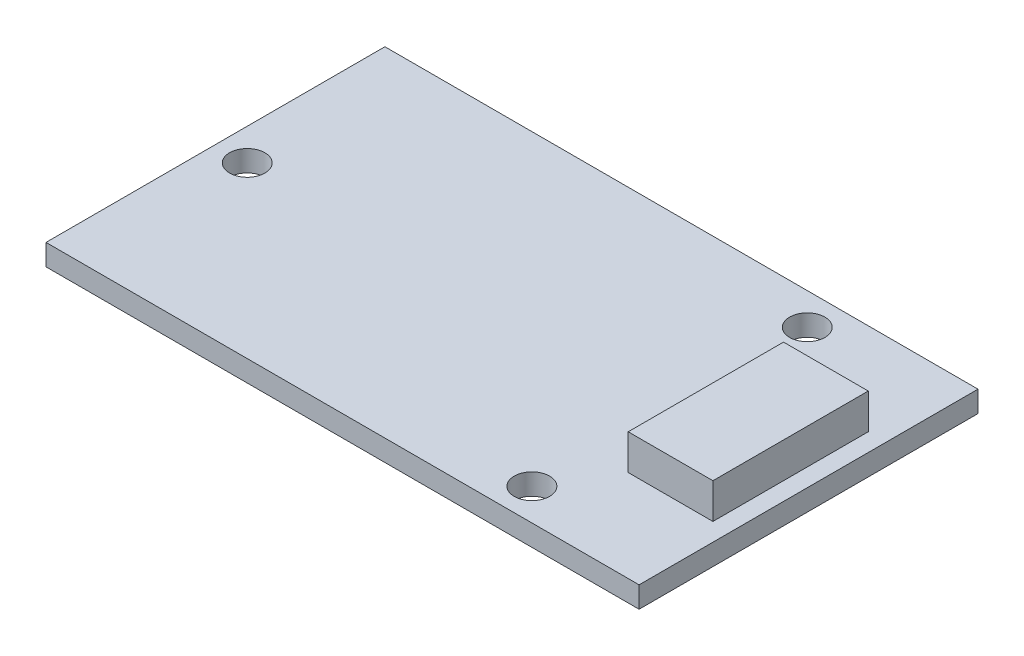
ISO-10303-21;
HEADER;
FILE_DESCRIPTION(('STEP AP214'),'2;1');
FILE_NAME('part.step','',(''),(''),'','','');
FILE_SCHEMA(('AUTOMOTIVE_DESIGN { 1 0 10303 214 1 1 1 1 }'));
ENDSEC;
DATA;
#1=APPLICATION_CONTEXT('core data for automotive mechanical design processes');
#2=APPLICATION_PROTOCOL_DEFINITION('international standard','automotive_design',2000,#1);
#3=PRODUCT_CONTEXT('',#1,'mechanical');
#4=PRODUCT('Part','Part','',(#3));
#5=PRODUCT_RELATED_PRODUCT_CATEGORY('part','',(#4));
#6=PRODUCT_DEFINITION_FORMATION('','',#4);
#7=PRODUCT_DEFINITION_CONTEXT('part definition',#1,'design');
#8=PRODUCT_DEFINITION('design','',#6,#7);
#9=PRODUCT_DEFINITION_SHAPE('','',#8);
#10=(LENGTH_UNIT() NAMED_UNIT(*) SI_UNIT(.MILLI.,.METRE.));
#11=(NAMED_UNIT(*) PLANE_ANGLE_UNIT() SI_UNIT($,.RADIAN.));
#12=(NAMED_UNIT(*) SI_UNIT($,.STERADIAN.) SOLID_ANGLE_UNIT());
#13=UNCERTAINTY_MEASURE_WITH_UNIT(LENGTH_MEASURE(1.E-05),#10,'distance_accuracy_value','');
#14=(GEOMETRIC_REPRESENTATION_CONTEXT(3) GLOBAL_UNCERTAINTY_ASSIGNED_CONTEXT((#13)) GLOBAL_UNIT_ASSIGNED_CONTEXT((#10,
#11,#12)) REPRESENTATION_CONTEXT('',''));
#15=CARTESIAN_POINT('',(0.,0.,0.));
#16=DIRECTION('',(0.,0.,1.));
#17=DIRECTION('',(1.,0.,0.));
#18=AXIS2_PLACEMENT_3D('',#15,#16,#17);
#19=CARTESIAN_POINT('',(0.,1.5,0.));
#20=DIRECTION('',(0.,1.,0.));
#21=DIRECTION('',(0.,0.,1.));
#22=AXIS2_PLACEMENT_3D('',#19,#20,#21);
#23=PLANE('',#22);
#24=CARTESIAN_POINT('',(2.25,1.5,12.));
#25=DIRECTION('',(0.,1.,0.));
#26=DIRECTION('',(0.,0.,1.));
#27=AXIS2_PLACEMENT_3D('',#24,#25,#26);
#28=CIRCLE('',#27,1.25);
#29=CARTESIAN_POINT('',(2.25,1.5,13.25));
#30=VERTEX_POINT('',#29);
#31=EDGE_CURVE('E152',#30,#30,#28,.T.);
#32=ORIENTED_EDGE('',*,*,#31,.F.);
#33=EDGE_LOOP('',(#32));
#34=FACE_BOUND('',#33,.T.);
#35=CARTESIAN_POINT('',(32.16,1.5,21.75));
#36=DIRECTION('',(0.,1.,0.));
#37=DIRECTION('',(0.,0.,1.));
#38=AXIS2_PLACEMENT_3D('',#35,#36,#37);
#39=CIRCLE('',#38,1.25);
#40=CARTESIAN_POINT('',(32.16,1.5,23.));
#41=VERTEX_POINT('',#40);
#42=EDGE_CURVE('E155',#41,#41,#39,.T.);
#43=ORIENTED_EDGE('',*,*,#42,.F.);
#44=EDGE_LOOP('',(#43));
#45=FACE_BOUND('',#44,.T.);
#46=CARTESIAN_POINT('',(32.16,1.5,2.25));
#47=DIRECTION('',(0.,1.,0.));
#48=DIRECTION('',(0.,0.,1.));
#49=AXIS2_PLACEMENT_3D('',#46,#47,#48);
#50=CIRCLE('',#49,1.25);
#51=CARTESIAN_POINT('',(32.16,1.5,3.5));
#52=VERTEX_POINT('',#51);
#53=EDGE_CURVE('E159',#52,#52,#50,.T.);
#54=ORIENTED_EDGE('',*,*,#53,.F.);
#55=EDGE_LOOP('',(#54));
#56=FACE_BOUND('',#55,.T.);
#57=DIRECTION('',(0.,0.,1.));
#58=VECTOR('',#57,1.);
#59=CARTESIAN_POINT('',(42.,1.5,0.));
#60=LINE('',#59,#58);
#61=CARTESIAN_POINT('',(42.,1.5,0.));
#62=VERTEX_POINT('',#61);
#63=CARTESIAN_POINT('',(42.,1.5,24.));
#64=VERTEX_POINT('',#63);
#65=EDGE_CURVE('E162',#62,#64,#60,.T.);
#66=ORIENTED_EDGE('',*,*,#65,.F.);
#67=DIRECTION('',(1.,0.,0.));
#68=VECTOR('',#67,1.);
#69=CARTESIAN_POINT('',(0.,1.5,0.));
#70=LINE('',#69,#68);
#71=CARTESIAN_POINT('',(0.,1.5,0.));
#72=VERTEX_POINT('',#71);
#73=EDGE_CURVE('E165',#72,#62,#70,.T.);
#74=ORIENTED_EDGE('',*,*,#73,.F.);
#75=DIRECTION('',(0.,0.,1.));
#76=VECTOR('',#75,1.);
#77=CARTESIAN_POINT('',(0.,1.5,0.));
#78=LINE('',#77,#76);
#79=CARTESIAN_POINT('',(0.,1.5,24.));
#80=VERTEX_POINT('',#79);
#81=EDGE_CURVE('E168',#72,#80,#78,.T.);
#82=ORIENTED_EDGE('',*,*,#81,.T.);
#83=DIRECTION('',(1.,0.,0.));
#84=VECTOR('',#83,1.);
#85=CARTESIAN_POINT('',(0.,1.5,24.));
#86=LINE('',#85,#84);
#87=EDGE_CURVE('E171',#80,#64,#86,.T.);
#88=ORIENTED_EDGE('',*,*,#87,.T.);
#89=EDGE_LOOP('',(#66,#74,#82,#88));
#90=FACE_BOUND('',#89,.T.);
#91=DIRECTION('',(0.,0.,-1.));
#92=VECTOR('',#91,1.);
#93=CARTESIAN_POINT('',(34.7285084004167,1.5,0.));
#94=LINE('',#93,#92);
#95=CARTESIAN_POINT('',(34.7285084004167,1.5,17.5));
#96=VERTEX_POINT('',#95);
#97=CARTESIAN_POINT('',(34.7285084004167,1.5,6.5));
#98=VERTEX_POINT('',#97);
#99=EDGE_CURVE('E68',#96,#98,#94,.T.);
#100=ORIENTED_EDGE('',*,*,#99,.T.);
#101=DIRECTION('',(1.,0.,0.));
#102=VECTOR('',#101,1.);
#103=CARTESIAN_POINT('',(0.,1.5,6.5));
#104=LINE('',#103,#102);
#105=CARTESIAN_POINT('',(40.7285084004167,1.5,6.5));
#106=VERTEX_POINT('',#105);
#107=EDGE_CURVE('E12',#98,#106,#104,.T.);
#108=ORIENTED_EDGE('',*,*,#107,.T.);
#109=DIRECTION('',(0.,0.,-1.));
#110=VECTOR('',#109,1.);
#111=CARTESIAN_POINT('',(40.7285084004167,1.5,0.));
#112=LINE('',#111,#110);
#113=CARTESIAN_POINT('',(40.7285084004167,1.5,17.5));
#114=VERTEX_POINT('',#113);
#115=EDGE_CURVE('E198',#114,#106,#112,.T.);
#116=ORIENTED_EDGE('',*,*,#115,.F.);
#117=DIRECTION('',(1.,0.,0.));
#118=VECTOR('',#117,1.);
#119=CARTESIAN_POINT('',(0.,1.5,17.5));
#120=LINE('',#119,#118);
#121=EDGE_CURVE('E78',#96,#114,#120,.T.);
#122=ORIENTED_EDGE('',*,*,#121,.F.);
#123=EDGE_LOOP('',(#100,#108,#116,#122));
#124=FACE_BOUND('',#123,.T.);
#125=ADVANCED_FACE('F60',(#34,#45,#56,#90,#124),#23,.T.);
#126=CARTESIAN_POINT('',(0.,1.5,0.));
#127=DIRECTION('',(0.,0.,-1.));
#128=DIRECTION('',(-1.,0.,0.));
#129=AXIS2_PLACEMENT_3D('',#126,#127,#128);
#130=PLANE('',#129);
#131=DIRECTION('',(1.,0.,0.));
#132=VECTOR('',#131,1.);
#133=CARTESIAN_POINT('',(0.,0.,0.));
#134=LINE('',#133,#132);
#135=CARTESIAN_POINT('',(0.,0.,0.));
#136=VERTEX_POINT('',#135);
#137=CARTESIAN_POINT('',(42.,0.,0.));
#138=VERTEX_POINT('',#137);
#139=EDGE_CURVE('E182',#136,#138,#134,.T.);
#140=ORIENTED_EDGE('',*,*,#139,.F.);
#141=DIRECTION('',(0.,-1.,0.));
#142=VECTOR('',#141,1.);
#143=CARTESIAN_POINT('',(0.,1.5,0.));
#144=LINE('',#143,#142);
#145=EDGE_CURVE('E194',#72,#136,#144,.T.);
#146=ORIENTED_EDGE('',*,*,#145,.F.);
#147=ORIENTED_EDGE('',*,*,#73,.T.);
#148=DIRECTION('',(0.,-1.,0.));
#149=VECTOR('',#148,1.);
#150=CARTESIAN_POINT('',(42.,1.5,0.));
#151=LINE('',#150,#149);
#152=EDGE_CURVE('E196',#62,#138,#151,.T.);
#153=ORIENTED_EDGE('',*,*,#152,.T.);
#154=EDGE_LOOP('',(#140,#146,#147,#153));
#155=FACE_BOUND('',#154,.T.);
#156=ADVANCED_FACE('F211',(#155),#130,.T.);
#157=CARTESIAN_POINT('',(0.,1.5,0.));
#158=DIRECTION('',(1.,0.,0.));
#159=DIRECTION('',(0.,0.,-1.));
#160=AXIS2_PLACEMENT_3D('',#157,#158,#159);
#161=PLANE('',#160);
#162=DIRECTION('',(0.,0.,1.));
#163=VECTOR('',#162,1.);
#164=CARTESIAN_POINT('',(0.,0.,0.));
#165=LINE('',#164,#163);
#166=CARTESIAN_POINT('',(0.,0.,24.));
#167=VERTEX_POINT('',#166);
#168=EDGE_CURVE('E185',#136,#167,#165,.T.);
#169=ORIENTED_EDGE('',*,*,#168,.T.);
#170=DIRECTION('',(0.,-1.,0.));
#171=VECTOR('',#170,1.);
#172=CARTESIAN_POINT('',(0.,1.5,24.));
#173=LINE('',#172,#171);
#174=EDGE_CURVE('E191',#80,#167,#173,.T.);
#175=ORIENTED_EDGE('',*,*,#174,.F.);
#176=ORIENTED_EDGE('',*,*,#81,.F.);
#177=ORIENTED_EDGE('',*,*,#145,.T.);
#178=EDGE_LOOP('',(#169,#175,#176,#177));
#179=FACE_BOUND('',#178,.T.);
#180=ADVANCED_FACE('F217',(#179),#161,.F.);
#181=CARTESIAN_POINT('',(0.,1.5,24.));
#182=DIRECTION('',(0.,0.,-1.));
#183=DIRECTION('',(-1.,0.,0.));
#184=AXIS2_PLACEMENT_3D('',#181,#182,#183);
#185=PLANE('',#184);
#186=DIRECTION('',(1.,0.,0.));
#187=VECTOR('',#186,1.);
#188=CARTESIAN_POINT('',(0.,0.,24.));
#189=LINE('',#188,#187);
#190=CARTESIAN_POINT('',(42.,0.,24.));
#191=VERTEX_POINT('',#190);
#192=EDGE_CURVE('E156',#167,#191,#189,.T.);
#193=ORIENTED_EDGE('',*,*,#192,.T.);
#194=DIRECTION('',(0.,-1.,0.));
#195=VECTOR('',#194,1.);
#196=CARTESIAN_POINT('',(42.,1.5,24.));
#197=LINE('',#196,#195);
#198=EDGE_CURVE('E172',#64,#191,#197,.T.);
#199=ORIENTED_EDGE('',*,*,#198,.F.);
#200=ORIENTED_EDGE('',*,*,#87,.F.);
#201=ORIENTED_EDGE('',*,*,#174,.T.);
#202=EDGE_LOOP('',(#193,#199,#200,#201));
#203=FACE_BOUND('',#202,.T.);
#204=ADVANCED_FACE('F229',(#203),#185,.F.);
#205=CARTESIAN_POINT('',(42.,1.5,0.));
#206=DIRECTION('',(1.,0.,0.));
#207=DIRECTION('',(0.,0.,-1.));
#208=AXIS2_PLACEMENT_3D('',#205,#206,#207);
#209=PLANE('',#208);
#210=DIRECTION('',(0.,0.,1.));
#211=VECTOR('',#210,1.);
#212=CARTESIAN_POINT('',(42.,0.,0.));
#213=LINE('',#212,#211);
#214=EDGE_CURVE('E179',#138,#191,#213,.T.);
#215=ORIENTED_EDGE('',*,*,#214,.F.);
#216=ORIENTED_EDGE('',*,*,#152,.F.);
#217=ORIENTED_EDGE('',*,*,#65,.T.);
#218=ORIENTED_EDGE('',*,*,#198,.T.);
#219=EDGE_LOOP('',(#215,#216,#217,#218));
#220=FACE_BOUND('',#219,.T.);
#221=ADVANCED_FACE('F232',(#220),#209,.T.);
#222=CARTESIAN_POINT('',(32.16,1.5,2.25));
#223=DIRECTION('',(0.,-1.,0.));
#224=DIRECTION('',(0.,0.,-1.));
#225=AXIS2_PLACEMENT_3D('',#222,#223,#224);
#226=CYLINDRICAL_SURFACE('',#225,1.25);
#227=ORIENTED_EDGE('',*,*,#53,.T.);
#228=EDGE_LOOP('',(#227));
#229=FACE_BOUND('',#228,.T.);
#230=CARTESIAN_POINT('',(32.16,0.,2.25));
#231=DIRECTION('',(0.,1.,0.));
#232=DIRECTION('',(0.,0.,1.));
#233=AXIS2_PLACEMENT_3D('',#230,#231,#232);
#234=CIRCLE('',#233,1.25);
#235=CARTESIAN_POINT('',(32.16,0.,3.5));
#236=VERTEX_POINT('',#235);
#237=EDGE_CURVE('E176',#236,#236,#234,.T.);
#238=ORIENTED_EDGE('',*,*,#237,.F.);
#239=EDGE_LOOP('',(#238));
#240=FACE_BOUND('',#239,.T.);
#241=ADVANCED_FACE('F239',(#229,#240),#226,.F.);
#242=CARTESIAN_POINT('',(32.16,1.5,21.75));
#243=DIRECTION('',(0.,-1.,0.));
#244=DIRECTION('',(0.,0.,-1.));
#245=AXIS2_PLACEMENT_3D('',#242,#243,#244);
#246=CYLINDRICAL_SURFACE('',#245,1.25);
#247=ORIENTED_EDGE('',*,*,#42,.T.);
#248=EDGE_LOOP('',(#247));
#249=FACE_BOUND('',#248,.T.);
#250=CARTESIAN_POINT('',(32.16,0.,21.75));
#251=DIRECTION('',(0.,1.,0.));
#252=DIRECTION('',(0.,0.,1.));
#253=AXIS2_PLACEMENT_3D('',#250,#251,#252);
#254=CIRCLE('',#253,1.25);
#255=CARTESIAN_POINT('',(32.16,0.,23.));
#256=VERTEX_POINT('',#255);
#257=EDGE_CURVE('E146',#256,#256,#254,.T.);
#258=ORIENTED_EDGE('',*,*,#257,.F.);
#259=EDGE_LOOP('',(#258));
#260=FACE_BOUND('',#259,.T.);
#261=ADVANCED_FACE('F242',(#249,#260),#246,.F.);
#262=CARTESIAN_POINT('',(2.25,1.5,12.));
#263=DIRECTION('',(0.,-1.,0.));
#264=DIRECTION('',(0.,0.,-1.));
#265=AXIS2_PLACEMENT_3D('',#262,#263,#264);
#266=CYLINDRICAL_SURFACE('',#265,1.25);
#267=ORIENTED_EDGE('',*,*,#31,.T.);
#268=EDGE_LOOP('',(#267));
#269=FACE_BOUND('',#268,.T.);
#270=CARTESIAN_POINT('',(2.25,0.,12.));
#271=DIRECTION('',(0.,1.,0.));
#272=DIRECTION('',(0.,0.,1.));
#273=AXIS2_PLACEMENT_3D('',#270,#271,#272);
#274=CIRCLE('',#273,1.25);
#275=CARTESIAN_POINT('',(2.25,0.,13.25));
#276=VERTEX_POINT('',#275);
#277=EDGE_CURVE('E143',#276,#276,#274,.T.);
#278=ORIENTED_EDGE('',*,*,#277,.F.);
#279=EDGE_LOOP('',(#278));
#280=FACE_BOUND('',#279,.T.);
#281=ADVANCED_FACE('F62',(#269,#280),#266,.F.);
#282=CARTESIAN_POINT('',(0.,0.,0.));
#283=DIRECTION('',(0.,1.,0.));
#284=DIRECTION('',(0.,0.,1.));
#285=AXIS2_PLACEMENT_3D('',#282,#283,#284);
#286=PLANE('',#285);
#287=ORIENTED_EDGE('',*,*,#214,.T.);
#288=ORIENTED_EDGE('',*,*,#192,.F.);
#289=ORIENTED_EDGE('',*,*,#168,.F.);
#290=ORIENTED_EDGE('',*,*,#139,.T.);
#291=EDGE_LOOP('',(#287,#288,#289,#290));
#292=FACE_BOUND('',#291,.T.);
#293=ORIENTED_EDGE('',*,*,#237,.T.);
#294=EDGE_LOOP('',(#293));
#295=FACE_BOUND('',#294,.T.);
#296=ORIENTED_EDGE('',*,*,#257,.T.);
#297=EDGE_LOOP('',(#296));
#298=FACE_BOUND('',#297,.T.);
#299=ORIENTED_EDGE('',*,*,#277,.T.);
#300=EDGE_LOOP('',(#299));
#301=FACE_BOUND('',#300,.T.);
#302=ADVANCED_FACE('F225',(#292,#295,#298,#301),#286,.F.);
#303=CARTESIAN_POINT('',(40.7285084004167,4.,6.5));
#304=DIRECTION('',(0.,0.,1.));
#305=DIRECTION('',(1.,0.,0.));
#306=AXIS2_PLACEMENT_3D('',#303,#304,#305);
#307=PLANE('',#306);
#308=ORIENTED_EDGE('',*,*,#107,.F.);
#309=DIRECTION('',(0.,-1.,0.));
#310=VECTOR('',#309,1.);
#311=CARTESIAN_POINT('',(34.7285084004167,4.,6.5));
#312=LINE('',#311,#310);
#313=CARTESIAN_POINT('',(34.7285084004167,4.,6.5));
#314=VERTEX_POINT('',#313);
#315=EDGE_CURVE('E125',#314,#98,#312,.T.);
#316=ORIENTED_EDGE('',*,*,#315,.F.);
#317=DIRECTION('',(-1.,0.,0.));
#318=VECTOR('',#317,1.);
#319=CARTESIAN_POINT('',(40.7285084004167,4.,6.5));
#320=LINE('',#319,#318);
#321=CARTESIAN_POINT('',(40.7285084004167,4.,6.5));
#322=VERTEX_POINT('',#321);
#323=EDGE_CURVE('E132',#322,#314,#320,.T.);
#324=ORIENTED_EDGE('',*,*,#323,.F.);
#325=DIRECTION('',(0.,-1.,0.));
#326=VECTOR('',#325,1.);
#327=CARTESIAN_POINT('',(40.7285084004167,4.,6.5));
#328=LINE('',#327,#326);
#329=EDGE_CURVE('E206',#322,#106,#328,.T.);
#330=ORIENTED_EDGE('',*,*,#329,.T.);
#331=EDGE_LOOP('',(#308,#316,#324,#330));
#332=FACE_BOUND('',#331,.T.);
#333=ADVANCED_FACE('F142',(#332),#307,.F.);
#334=CARTESIAN_POINT('',(34.7285084004167,4.,6.5));
#335=DIRECTION('',(1.,0.,0.));
#336=DIRECTION('',(0.,0.,-1.));
#337=AXIS2_PLACEMENT_3D('',#334,#335,#336);
#338=PLANE('',#337);
#339=ORIENTED_EDGE('',*,*,#99,.F.);
#340=DIRECTION('',(0.,-1.,0.));
#341=VECTOR('',#340,1.);
#342=CARTESIAN_POINT('',(34.7285084004167,4.,17.5));
#343=LINE('',#342,#341);
#344=CARTESIAN_POINT('',(34.7285084004167,4.,17.5));
#345=VERTEX_POINT('',#344);
#346=EDGE_CURVE('E127',#345,#96,#343,.T.);
#347=ORIENTED_EDGE('',*,*,#346,.F.);
#348=DIRECTION('',(0.,0.,1.));
#349=VECTOR('',#348,1.);
#350=CARTESIAN_POINT('',(34.7285084004167,4.,6.5));
#351=LINE('',#350,#349);
#352=EDGE_CURVE('E121',#314,#345,#351,.T.);
#353=ORIENTED_EDGE('',*,*,#352,.F.);
#354=ORIENTED_EDGE('',*,*,#315,.T.);
#355=EDGE_LOOP('',(#339,#347,#353,#354));
#356=FACE_BOUND('',#355,.T.);
#357=ADVANCED_FACE('F123',(#356),#338,.F.);
#358=CARTESIAN_POINT('',(40.7285084004167,4.,17.5));
#359=DIRECTION('',(0.,0.,1.));
#360=DIRECTION('',(1.,0.,0.));
#361=AXIS2_PLACEMENT_3D('',#358,#359,#360);
#362=PLANE('',#361);
#363=ORIENTED_EDGE('',*,*,#346,.T.);
#364=ORIENTED_EDGE('',*,*,#121,.T.);
#365=DIRECTION('',(0.,-1.,0.));
#366=VECTOR('',#365,1.);
#367=CARTESIAN_POINT('',(40.7285084004167,4.,17.5));
#368=LINE('',#367,#366);
#369=CARTESIAN_POINT('',(40.7285084004167,4.,17.5));
#370=VERTEX_POINT('',#369);
#371=EDGE_CURVE('E148',#370,#114,#368,.T.);
#372=ORIENTED_EDGE('',*,*,#371,.F.);
#373=DIRECTION('',(-1.,0.,0.));
#374=VECTOR('',#373,1.);
#375=CARTESIAN_POINT('',(40.7285084004167,4.,17.5));
#376=LINE('',#375,#374);
#377=EDGE_CURVE('E131',#370,#345,#376,.T.);
#378=ORIENTED_EDGE('',*,*,#377,.T.);
#379=EDGE_LOOP('',(#363,#364,#372,#378));
#380=FACE_BOUND('',#379,.T.);
#381=ADVANCED_FACE('F203',(#380),#362,.T.);
#382=CARTESIAN_POINT('',(40.7285084004167,4.,6.5));
#383=DIRECTION('',(1.,0.,0.));
#384=DIRECTION('',(0.,0.,-1.));
#385=AXIS2_PLACEMENT_3D('',#382,#383,#384);
#386=PLANE('',#385);
#387=ORIENTED_EDGE('',*,*,#371,.T.);
#388=ORIENTED_EDGE('',*,*,#115,.T.);
#389=ORIENTED_EDGE('',*,*,#329,.F.);
#390=DIRECTION('',(0.,0.,1.));
#391=VECTOR('',#390,1.);
#392=CARTESIAN_POINT('',(40.7285084004167,4.,6.5));
#393=LINE('',#392,#391);
#394=EDGE_CURVE('E138',#322,#370,#393,.T.);
#395=ORIENTED_EDGE('',*,*,#394,.T.);
#396=EDGE_LOOP('',(#387,#388,#389,#395));
#397=FACE_BOUND('',#396,.T.);
#398=ADVANCED_FACE('F205',(#397),#386,.T.);
#399=CARTESIAN_POINT('',(0.,4.,0.));
#400=DIRECTION('',(0.,1.,0.));
#401=DIRECTION('',(0.,0.,1.));
#402=AXIS2_PLACEMENT_3D('',#399,#400,#401);
#403=PLANE('',#402);
#404=ORIENTED_EDGE('',*,*,#323,.T.);
#405=ORIENTED_EDGE('',*,*,#352,.T.);
#406=ORIENTED_EDGE('',*,*,#377,.F.);
#407=ORIENTED_EDGE('',*,*,#394,.F.);
#408=EDGE_LOOP('',(#404,#405,#406,#407));
#409=FACE_BOUND('',#408,.T.);
#410=ADVANCED_FACE('F136',(#409),#403,.T.);
#411=CLOSED_SHELL('',(#125,#156,#180,#204,#221,#241,#261,#281,#302,#333,#357,#381,#398,#410));
#412=MANIFOLD_SOLID_BREP('B2',#411);
#413=ADVANCED_BREP_SHAPE_REPRESENTATION('',(#18,#412),#14);
#414=SHAPE_DEFINITION_REPRESENTATION(#9,#413);
ENDSEC;
END-ISO-10303-21;
